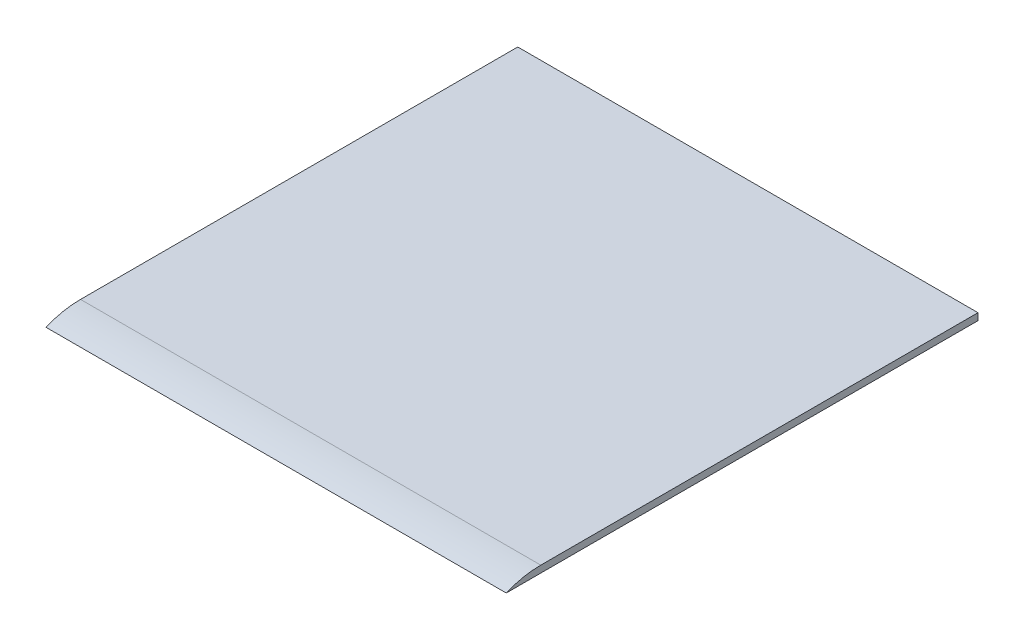
ISO-10303-21;
HEADER;
FILE_DESCRIPTION(('STEP AP214'),'2;1');
FILE_NAME('part.step','',(''),(''),'','','');
FILE_SCHEMA(('AUTOMOTIVE_DESIGN { 1 0 10303 214 1 1 1 1 }'));
ENDSEC;
DATA;
#1=APPLICATION_CONTEXT('core data for automotive mechanical design processes');
#2=APPLICATION_PROTOCOL_DEFINITION('international standard','automotive_design',2000,#1);
#3=PRODUCT_CONTEXT('',#1,'mechanical');
#4=PRODUCT('Part','Part','',(#3));
#5=PRODUCT_RELATED_PRODUCT_CATEGORY('part','',(#4));
#6=PRODUCT_DEFINITION_FORMATION('','',#4);
#7=PRODUCT_DEFINITION_CONTEXT('part definition',#1,'design');
#8=PRODUCT_DEFINITION('design','',#6,#7);
#9=PRODUCT_DEFINITION_SHAPE('','',#8);
#10=(LENGTH_UNIT() NAMED_UNIT(*) SI_UNIT(.MILLI.,.METRE.));
#11=(NAMED_UNIT(*) PLANE_ANGLE_UNIT() SI_UNIT($,.RADIAN.));
#12=(NAMED_UNIT(*) SI_UNIT($,.STERADIAN.) SOLID_ANGLE_UNIT());
#13=UNCERTAINTY_MEASURE_WITH_UNIT(LENGTH_MEASURE(1.E-05),#10,'distance_accuracy_value','');
#14=(GEOMETRIC_REPRESENTATION_CONTEXT(3) GLOBAL_UNCERTAINTY_ASSIGNED_CONTEXT((#13)) GLOBAL_UNIT_ASSIGNED_CONTEXT((#10,
#11,#12)) REPRESENTATION_CONTEXT('',''));
#15=CARTESIAN_POINT('',(0.,0.,0.));
#16=DIRECTION('',(0.,0.,1.));
#17=DIRECTION('',(1.,0.,0.));
#18=AXIS2_PLACEMENT_3D('',#15,#16,#17);
#19=CARTESIAN_POINT('',(100.,-35.9999999999996,87.5));
#20=DIRECTION('',(-1.,0.,0.));
#21=DIRECTION('',(0.,0.,1.));
#22=AXIS2_PLACEMENT_3D('',#19,#20,#21);
#23=CYLINDRICAL_SURFACE('',#22,38.9999999999996);
#24=CARTESIAN_POINT('',(-100.,-35.9999999999996,87.5));
#25=DIRECTION('',(1.,0.,0.));
#26=DIRECTION('',(0.,0.,-1.));
#27=AXIS2_PLACEMENT_3D('',#24,#25,#26);
#28=CIRCLE('',#27,38.9999999999996);
#29=CARTESIAN_POINT('',(-100.,3.00000000000001,87.5));
#30=VERTEX_POINT('',#29);
#31=CARTESIAN_POINT('',(-100.,0.,102.5));
#32=VERTEX_POINT('',#31);
#33=EDGE_CURVE('E96',#30,#32,#28,.T.);
#34=ORIENTED_EDGE('',*,*,#33,.T.);
#35=DIRECTION('',(-1.,0.,0.));
#36=VECTOR('',#35,1.);
#37=CARTESIAN_POINT('',(100.,0.,102.5));
#38=LINE('',#37,#36);
#39=CARTESIAN_POINT('',(100.,0.,102.5));
#40=VERTEX_POINT('',#39);
#41=EDGE_CURVE('E11',#40,#32,#38,.T.);
#42=ORIENTED_EDGE('',*,*,#41,.F.);
#43=CARTESIAN_POINT('',(100.,-35.9999999999996,87.5));
#44=DIRECTION('',(1.,0.,0.));
#45=DIRECTION('',(0.,0.,-1.));
#46=AXIS2_PLACEMENT_3D('',#43,#44,#45);
#47=CIRCLE('',#46,38.9999999999996);
#48=CARTESIAN_POINT('',(100.,3.00000000000001,87.5));
#49=VERTEX_POINT('',#48);
#50=EDGE_CURVE('E84',#49,#40,#47,.T.);
#51=ORIENTED_EDGE('',*,*,#50,.F.);
#52=DIRECTION('',(-1.,0.,0.));
#53=VECTOR('',#52,1.);
#54=CARTESIAN_POINT('',(100.,3.00000000000001,87.5));
#55=LINE('',#54,#53);
#56=EDGE_CURVE('E92',#49,#30,#55,.T.);
#57=ORIENTED_EDGE('',*,*,#56,.T.);
#58=EDGE_LOOP('',(#34,#42,#51,#57));
#59=FACE_BOUND('',#58,.T.);
#60=ADVANCED_FACE('F33',(#59),#23,.T.);
#61=CARTESIAN_POINT('',(100.,0.,-102.5));
#62=DIRECTION('',(0.,1.,0.));
#63=DIRECTION('',(0.,0.,1.));
#64=AXIS2_PLACEMENT_3D('',#61,#62,#63);
#65=PLANE('',#64);
#66=DIRECTION('',(0.,0.,-1.));
#67=VECTOR('',#66,1.);
#68=CARTESIAN_POINT('',(-100.,0.,-102.5));
#69=LINE('',#68,#67);
#70=CARTESIAN_POINT('',(-100.,0.,-102.5));
#71=VERTEX_POINT('',#70);
#72=EDGE_CURVE('E88',#32,#71,#69,.T.);
#73=ORIENTED_EDGE('',*,*,#72,.T.);
#74=DIRECTION('',(-1.,0.,0.));
#75=VECTOR('',#74,1.);
#76=CARTESIAN_POINT('',(100.,0.,-102.5));
#77=LINE('',#76,#75);
#78=CARTESIAN_POINT('',(100.,0.,-102.5));
#79=VERTEX_POINT('',#78);
#80=EDGE_CURVE('E41',#79,#71,#77,.T.);
#81=ORIENTED_EDGE('',*,*,#80,.F.);
#82=DIRECTION('',(0.,0.,-1.));
#83=VECTOR('',#82,1.);
#84=CARTESIAN_POINT('',(100.,0.,-102.5));
#85=LINE('',#84,#83);
#86=EDGE_CURVE('E79',#40,#79,#85,.T.);
#87=ORIENTED_EDGE('',*,*,#86,.F.);
#88=ORIENTED_EDGE('',*,*,#41,.T.);
#89=EDGE_LOOP('',(#73,#81,#87,#88));
#90=FACE_BOUND('',#89,.T.);
#91=ADVANCED_FACE('F87',(#90),#65,.F.);
#92=CARTESIAN_POINT('',(100.,0.,-102.5));
#93=DIRECTION('',(0.,0.,1.));
#94=DIRECTION('',(1.,0.,0.));
#95=AXIS2_PLACEMENT_3D('',#92,#93,#94);
#96=PLANE('',#95);
#97=DIRECTION('',(0.,1.,0.));
#98=VECTOR('',#97,1.);
#99=CARTESIAN_POINT('',(-100.,0.,-102.5));
#100=LINE('',#99,#98);
#101=CARTESIAN_POINT('',(-100.,3.00000000000004,-102.5));
#102=VERTEX_POINT('',#101);
#103=EDGE_CURVE('E66',#71,#102,#100,.T.);
#104=ORIENTED_EDGE('',*,*,#103,.T.);
#105=DIRECTION('',(-1.,0.,0.));
#106=VECTOR('',#105,1.);
#107=CARTESIAN_POINT('',(100.,3.00000000000004,-102.5));
#108=LINE('',#107,#106);
#109=CARTESIAN_POINT('',(100.,3.00000000000004,-102.5));
#110=VERTEX_POINT('',#109);
#111=EDGE_CURVE('E89',#110,#102,#108,.T.);
#112=ORIENTED_EDGE('',*,*,#111,.F.);
#113=DIRECTION('',(0.,1.,0.));
#114=VECTOR('',#113,1.);
#115=CARTESIAN_POINT('',(100.,0.,-102.5));
#116=LINE('',#115,#114);
#117=EDGE_CURVE('E82',#79,#110,#116,.T.);
#118=ORIENTED_EDGE('',*,*,#117,.F.);
#119=ORIENTED_EDGE('',*,*,#80,.T.);
#120=EDGE_LOOP('',(#104,#112,#118,#119));
#121=FACE_BOUND('',#120,.T.);
#122=ADVANCED_FACE('F90',(#121),#96,.F.);
#123=CARTESIAN_POINT('',(100.,3.00000000000004,-102.5));
#124=DIRECTION('',(0.,-1.,0.));
#125=DIRECTION('',(0.,0.,-1.));
#126=AXIS2_PLACEMENT_3D('',#123,#124,#125);
#127=PLANE('',#126);
#128=DIRECTION('',(0.,0.,1.));
#129=VECTOR('',#128,1.);
#130=CARTESIAN_POINT('',(-100.,3.00000000000004,-102.5));
#131=LINE('',#130,#129);
#132=EDGE_CURVE('E72',#102,#30,#131,.T.);
#133=ORIENTED_EDGE('',*,*,#132,.T.);
#134=ORIENTED_EDGE('',*,*,#56,.F.);
#135=DIRECTION('',(0.,0.,1.));
#136=VECTOR('',#135,1.);
#137=CARTESIAN_POINT('',(100.,3.00000000000004,-102.5));
#138=LINE('',#137,#136);
#139=EDGE_CURVE('E49',#110,#49,#138,.T.);
#140=ORIENTED_EDGE('',*,*,#139,.F.);
#141=ORIENTED_EDGE('',*,*,#111,.T.);
#142=EDGE_LOOP('',(#133,#134,#140,#141));
#143=FACE_BOUND('',#142,.T.);
#144=ADVANCED_FACE('F103',(#143),#127,.F.);
#145=CARTESIAN_POINT('',(100.,-35.9999999999996,87.5));
#146=DIRECTION('',(1.,0.,0.));
#147=DIRECTION('',(0.,0.,-1.));
#148=AXIS2_PLACEMENT_3D('',#145,#146,#147);
#149=PLANE('',#148);
#150=ORIENTED_EDGE('',*,*,#50,.T.);
#151=ORIENTED_EDGE('',*,*,#86,.T.);
#152=ORIENTED_EDGE('',*,*,#117,.T.);
#153=ORIENTED_EDGE('',*,*,#139,.T.);
#154=EDGE_LOOP('',(#150,#151,#152,#153));
#155=FACE_BOUND('',#154,.T.);
#156=ADVANCED_FACE('F80',(#155),#149,.T.);
#157=CARTESIAN_POINT('',(-100.,-35.9999999999996,87.5));
#158=DIRECTION('',(1.,0.,0.));
#159=DIRECTION('',(0.,0.,-1.));
#160=AXIS2_PLACEMENT_3D('',#157,#158,#159);
#161=PLANE('',#160);
#162=ORIENTED_EDGE('',*,*,#33,.F.);
#163=ORIENTED_EDGE('',*,*,#132,.F.);
#164=ORIENTED_EDGE('',*,*,#103,.F.);
#165=ORIENTED_EDGE('',*,*,#72,.F.);
#166=EDGE_LOOP('',(#162,#163,#164,#165));
#167=FACE_BOUND('',#166,.T.);
#168=ADVANCED_FACE('F106',(#167),#161,.F.);
#169=CLOSED_SHELL('',(#60,#91,#122,#144,#156,#168));
#170=MANIFOLD_SOLID_BREP('B2',#169);
#171=ADVANCED_BREP_SHAPE_REPRESENTATION('',(#18,#170),#14);
#172=SHAPE_DEFINITION_REPRESENTATION(#9,#171);
ENDSEC;
END-ISO-10303-21;
